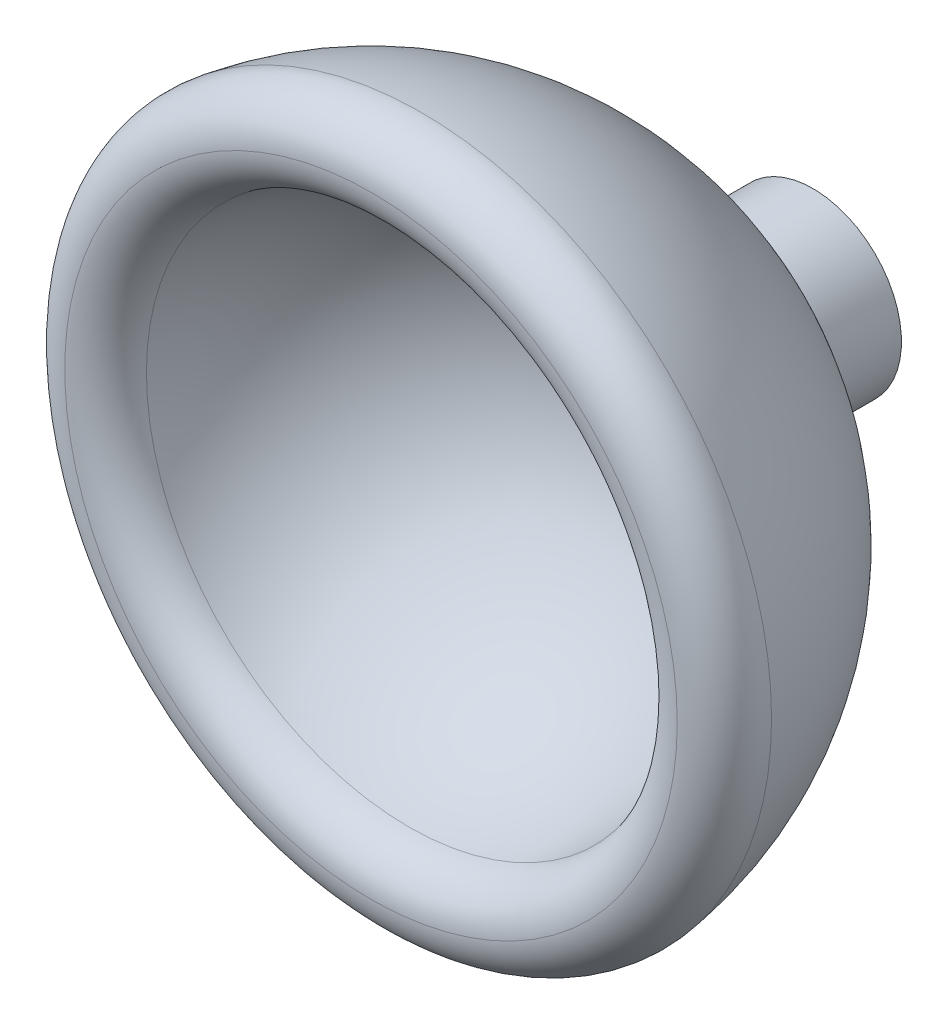
ISO-10303-21;
HEADER;
FILE_DESCRIPTION(('STEP AP214'),'2;1');
FILE_NAME('part.step','',(''),(''),'','','');
FILE_SCHEMA(('AUTOMOTIVE_DESIGN { 1 0 10303 214 1 1 1 1 }'));
ENDSEC;
DATA;
#1=APPLICATION_CONTEXT('core data for automotive mechanical design processes');
#2=APPLICATION_PROTOCOL_DEFINITION('international standard','automotive_design',2000,#1);
#3=PRODUCT_CONTEXT('',#1,'mechanical');
#4=PRODUCT('Part','Part','',(#3));
#5=PRODUCT_RELATED_PRODUCT_CATEGORY('part','',(#4));
#6=PRODUCT_DEFINITION_FORMATION('','',#4);
#7=PRODUCT_DEFINITION_CONTEXT('part definition',#1,'design');
#8=PRODUCT_DEFINITION('design','',#6,#7);
#9=PRODUCT_DEFINITION_SHAPE('','',#8);
#10=(LENGTH_UNIT() NAMED_UNIT(*) SI_UNIT(.MILLI.,.METRE.));
#11=(NAMED_UNIT(*) PLANE_ANGLE_UNIT() SI_UNIT($,.RADIAN.));
#12=(NAMED_UNIT(*) SI_UNIT($,.STERADIAN.) SOLID_ANGLE_UNIT());
#13=UNCERTAINTY_MEASURE_WITH_UNIT(LENGTH_MEASURE(1.E-05),#10,'distance_accuracy_value','');
#14=(GEOMETRIC_REPRESENTATION_CONTEXT(3) GLOBAL_UNCERTAINTY_ASSIGNED_CONTEXT((#13)) GLOBAL_UNIT_ASSIGNED_CONTEXT((#10,
#11,#12)) REPRESENTATION_CONTEXT('',''));
#15=CARTESIAN_POINT('',(0.,0.,0.));
#16=DIRECTION('',(0.,0.,1.));
#17=DIRECTION('',(1.,0.,0.));
#18=AXIS2_PLACEMENT_3D('',#15,#16,#17);
#19=CARTESIAN_POINT('',(0.,0.,-50.));
#20=DIRECTION('',(0.,0.,-1.));
#21=DIRECTION('',(-1.,0.,0.));
#22=AXIS2_PLACEMENT_3D('',#19,#20,#21);
#23=PLANE('',#22);
#24=CARTESIAN_POINT('',(0.,0.,-50.));
#25=DIRECTION('',(0.,0.,-1.));
#26=DIRECTION('',(-1.,0.,0.));
#27=AXIS2_PLACEMENT_3D('',#24,#25,#26);
#28=CIRCLE('',#27,10.);
#29=CARTESIAN_POINT('',(-10.,0.,-50.));
#30=VERTEX_POINT('',#29);
#31=EDGE_CURVE('E50',#30,#30,#28,.T.);
#32=ORIENTED_EDGE('',*,*,#31,.T.);
#33=EDGE_LOOP('',(#32));
#34=FACE_BOUND('',#33,.T.);
#35=ADVANCED_FACE('F36',(#34),#23,.T.);
#36=CARTESIAN_POINT('',(0.,0.,-50.));
#37=DIRECTION('',(0.,0.,-1.));
#38=DIRECTION('',(-1.,0.,0.));
#39=AXIS2_PLACEMENT_3D('',#36,#37,#38);
#40=CYLINDRICAL_SURFACE('',#39,10.);
#41=CARTESIAN_POINT('',(0.,0.,-38.7298334620742));
#42=DIRECTION('',(0.,0.,-1.));
#43=DIRECTION('',(-1.,0.,0.));
#44=AXIS2_PLACEMENT_3D('',#41,#42,#43);
#45=CIRCLE('',#44,10.);
#46=CARTESIAN_POINT('',(10.,0.,-38.7298334620742));
#47=VERTEX_POINT('',#46);
#48=EDGE_CURVE('E56',#47,#47,#45,.T.);
#49=ORIENTED_EDGE('',*,*,#48,.T.);
#50=EDGE_LOOP('',(#49));
#51=FACE_BOUND('',#50,.T.);
#52=ORIENTED_EDGE('',*,*,#31,.F.);
#53=EDGE_LOOP('',(#52));
#54=FACE_BOUND('',#53,.T.);
#55=ADVANCED_FACE('F80',(#51,#54),#40,.T.);
#56=CARTESIAN_POINT('',(0.,0.,0.));
#57=DIRECTION('',(0.,0.,-1.));
#58=DIRECTION('',(1.,0.,0.));
#59=AXIS2_PLACEMENT_3D('',#56,#57,#58);
#60=SPHERICAL_SURFACE('',#59,40.);
#61=CARTESIAN_POINT('',(0.,0.,-5.71428571428572));
#62=DIRECTION('',(0.,0.,1.));
#63=DIRECTION('',(1.,0.,0.));
#64=AXIS2_PLACEMENT_3D('',#61,#62,#63);
#65=CIRCLE('',#64,39.5897327444315);
#66=CARTESIAN_POINT('',(39.5897327444315,0.,-5.71428571428571));
#67=VERTEX_POINT('',#66);
#68=EDGE_CURVE('E10',#67,#67,#65,.F.);
#69=CARTESIAN_POINT('',(39.5897327444315,0.,-5.71428571428571));
#70=CARTESIAN_POINT('',(39.5198103268833,0.,-6.19875285339644));
#71=CARTESIAN_POINT('',(39.4409867529464,0.,-6.68193494193146));
#72=CARTESIAN_POINT('',(39.2656623012291,0.,-7.64508130929309));
#73=CARTESIAN_POINT('',(39.1691614234488,0.,-8.12504558811971));
#74=CARTESIAN_POINT('',(38.9586073729788,0.,-9.08110862750756));
#75=CARTESIAN_POINT('',(38.8445542002891,0.,-9.55720738806879));
#76=CARTESIAN_POINT('',(38.599050605119,0.,-10.5048980533793));
#77=CARTESIAN_POINT('',(38.4676001826386,0.,-10.9764899581286));
#78=CARTESIAN_POINT('',(38.1874788669441,0.,-11.9145313363055));
#79=CARTESIAN_POINT('',(38.03880797373,0.,-12.3809808097331));
#80=CARTESIAN_POINT('',(37.7244461599347,0.,-13.3081087630357));
#81=CARTESIAN_POINT('',(37.5587552393534,0.,-13.7687872429109));
#82=CARTESIAN_POINT('',(37.210576627312,0.,-14.683752401424));
#83=CARTESIAN_POINT('',(37.0280889358518,0.,-15.138039080062));
#84=CARTESIAN_POINT('',(36.6465627065039,0.,-16.0396084478951));
#85=CARTESIAN_POINT('',(36.447524168616,0.,-16.4868911370901));
#86=CARTESIAN_POINT('',(36.033164465704,0.,-17.3738497746906));
#87=CARTESIAN_POINT('',(35.8178433006798,0.,-17.8135257230961));
#88=CARTESIAN_POINT('',(35.3712085073569,0.,-18.6846783789233));
#89=CARTESIAN_POINT('',(35.1398948790581,0.,-19.1161550863451));
#90=CARTESIAN_POINT('',(34.6615868736029,0.,-19.9703278090618));
#91=CARTESIAN_POINT('',(34.4145924964464,0.,-20.3930238243568));
#92=CARTESIAN_POINT('',(33.905255838989,0.,-21.229065544428));
#93=CARTESIAN_POINT('',(33.642913558688,0.,-21.6424112492043));
#94=CARTESIAN_POINT('',(33.1032346231984,0.,-22.4591953301672));
#95=CARTESIAN_POINT('',(32.8258979680098,0.,-22.8626337063538));
#96=CARTESIAN_POINT('',(32.2566040171941,0.,-23.6590594630262));
#97=CARTESIAN_POINT('',(31.9646467215669,0.,-24.0520468435121));
#98=CARTESIAN_POINT('',(31.3665049268615,0.,-24.8270410252663));
#99=CARTESIAN_POINT('',(31.0603204277832,0.,-25.2090478265347));
#100=CARTESIAN_POINT('',(30.4341368355159,0.,-25.9615660635905));
#101=CARTESIAN_POINT('',(30.1141377423268,0.,-26.332077499378));
#102=CARTESIAN_POINT('',(29.4607561875044,0.,-27.0611057101794));
#103=CARTESIAN_POINT('',(29.127373725871,0.,-27.4196224851933));
#104=CARTESIAN_POINT('',(28.4476746950401,0.,-28.1241782429684));
#105=CARTESIAN_POINT('',(28.1013581258426,0.,-28.4702172257295));
#106=CARTESIAN_POINT('',(27.3962575705601,0.,-29.149351082393));
#107=CARTESIAN_POINT('',(27.0374735844751,0.,-29.4824459562954));
#108=CARTESIAN_POINT('',(26.3079216869867,0.,-30.1352427219106));
#109=CARTESIAN_POINT('',(25.9371537755832,0.,-30.4549446136235));
#110=CARTESIAN_POINT('',(25.184133668372,0.,-31.0805245896946));
#111=CARTESIAN_POINT('',(24.8018814725643,0.,-31.3864026740528));
#112=CARTESIAN_POINT('',(24.0264079135005,0.,-31.9839228390034));
#113=CARTESIAN_POINT('',(23.6331865502446,0.,-32.2755649195958));
#114=CARTESIAN_POINT('',(22.8363045551021,0.,-32.8442200647705));
#115=CARTESIAN_POINT('',(22.4326439232156,0.,-33.1212331293528));
#116=CARTESIAN_POINT('',(21.6154273574706,0.,-33.6602569442566));
#117=CARTESIAN_POINT('',(21.201871423612,0.,-33.9222676945781));
#118=CARTESIAN_POINT('',(20.3654215551488,0.,-34.430933798972));
#119=CARTESIAN_POINT('',(19.9425276205441,0.,-34.6775891530444));
#120=CARTESIAN_POINT('',(19.0879716362402,0.,-35.1552120779399));
#121=CARTESIAN_POINT('',(18.6563095865409,0.,-35.3861796487629));
#122=CARTESIAN_POINT('',(17.7847990709142,0.,-35.832115752177));
#123=CARTESIAN_POINT('',(17.3449506049867,0.,-36.047084284768));
#124=CARTESIAN_POINT('',(16.4576599971973,0.,-36.4607326488366));
#125=CARTESIAN_POINT('',(16.0102178553353,0.,-36.6594124803141));
#126=CARTESIAN_POINT('',(15.1083428334693,0.,-37.0402156100446));
#127=CARTESIAN_POINT('',(14.6539099534652,0.,-37.2223389082975));
#128=CARTESIAN_POINT('',(13.7386659466419,0.,-37.569783897227));
#129=CARTESIAN_POINT('',(13.2778548198227,0.,-37.7351055879034));
#130=CARTESIAN_POINT('',(12.3504749098271,0.,-38.0487232627712));
#131=CARTESIAN_POINT('',(11.8839061266508,0.,-38.1970192469625));
#132=CARTESIAN_POINT('',(10.9456411047671,0.,-38.476390571621));
#133=CARTESIAN_POINT('',(10.4739448660598,0.,-38.6074659120883));
#134=CARTESIAN_POINT('',(10.,0.,-38.7298334620742));
#135=B_SPLINE_CURVE_WITH_KNOTS('',3,(#69,#70,#71,#72,#73,#74,#75,#76,#77,#78,#79,#80,#81,#82,
#83,#84,#85,#86,#87,#88,#89,#90,#91,#92,#93,#94,#95,#96,#97,#98,#99,#100,#101,#102,#103,#104,
#105,#106,#107,#108,#109,#110,#111,#112,#113,#114,#115,#116,#117,#118,#119,#120,#121,#122,#123,
#124,#125,#126,#127,#128,#129,#130,#131,#132,#133,#134),.UNSPECIFIED.,.F.,.F.,(4,2,2,2,2,2,2,2,
2,2,2,2,2,2,2,2,2,2,2,2,2,2,2,2,2,2,2,2,2,2,2,2,4),(0.,1.46837816747554,2.93675633495108,
4.40513450242662,5.87351266990216,7.3418908373777,8.81026900485324,10.2786471723288,
11.7470253398043,13.2154035072799,14.6837816747554,16.1521598422309,17.6205380097065,
19.088916177182,20.5572943446575,22.0256725121331,23.4940506796086,24.9624288470842,
26.4308070145597,27.8991851820352,29.3675633495108,30.8359415169863,32.3043196844619,
33.7726978519374,35.2410760194129,36.7094541868885,38.177832354364,39.6462105218396,
41.1145886893151,42.5829668567906,44.0513450242662,45.5197231917417,46.9881013592173),.UNSPECIFIED.);
#136=EDGE_CURVE('BSEAM76',#67,#47,#135,.T.);
#137=ORIENTED_EDGE('',*,*,#68,.T.);
#138=ORIENTED_EDGE('',*,*,#48,.F.);
#139=ORIENTED_EDGE('',*,*,#136,.T.);
#140=ORIENTED_EDGE('',*,*,#136,.F.);
#141=EDGE_LOOP('',(#137,#139,#138,#140));
#142=FACE_BOUND('',#141,.T.);
#143=ADVANCED_FACE('F76',(#142),#60,.T.);
#144=CARTESIAN_POINT('',(0.,0.,0.));
#145=DIRECTION('',(0.,0.,-1.));
#146=DIRECTION('',(-1.,0.,0.));
#147=AXIS2_PLACEMENT_3D('',#144,#145,#146);
#148=SPHERICAL_SURFACE('',#147,30.);
#149=CARTESIAN_POINT('',(0.,0.,-4.28571428571429));
#150=DIRECTION('',(0.,0.,1.));
#151=DIRECTION('',(1.,0.,0.));
#152=AXIS2_PLACEMENT_3D('',#149,#150,#151);
#153=CIRCLE('',#152,29.6922995583236);
#154=CARTESIAN_POINT('',(29.6922995583236,0.,-4.28571428571429));
#155=VERTEX_POINT('',#154);
#156=EDGE_CURVE('E45',#155,#155,#153,.T.);
#157=ORIENTED_EDGE('',*,*,#156,.T.);
#158=EDGE_LOOP('',(#157));
#159=FACE_BOUND('',#158,.T.);
#160=ADVANCED_FACE('F68',(#159),#148,.F.);
#161=CARTESIAN_POINT('',(0.,0.,-5.00000000000001));
#162=DIRECTION('',(0.,0.,1.));
#163=DIRECTION('',(1.,0.,0.));
#164=AXIS2_PLACEMENT_3D('',#161,#162,#163);
#165=TOROIDAL_SURFACE('',#164,34.6410161513775,5.);
#166=ORIENTED_EDGE('',*,*,#68,.F.);
#167=EDGE_LOOP('',(#166));
#168=FACE_BOUND('',#167,.T.);
#169=CARTESIAN_POINT('',(0.,0.,0.));
#170=DIRECTION('',(0.,0.,1.));
#171=DIRECTION('',(1.,0.,0.));
#172=AXIS2_PLACEMENT_3D('',#169,#170,#171);
#173=CIRCLE('',#172,34.6410161513775);
#174=CARTESIAN_POINT('',(34.6410161513775,0.,0.));
#175=VERTEX_POINT('',#174);
#176=EDGE_CURVE('E40',#175,#175,#173,.T.);
#177=ORIENTED_EDGE('',*,*,#176,.F.);
#178=EDGE_LOOP('',(#177));
#179=FACE_BOUND('',#178,.T.);
#180=ADVANCED_FACE('F38',(#168,#179),#165,.T.);
#181=CARTESIAN_POINT('',(0.,0.,-5.00000000000001));
#182=DIRECTION('',(0.,0.,1.));
#183=DIRECTION('',(1.,0.,0.));
#184=AXIS2_PLACEMENT_3D('',#181,#182,#183);
#185=TOROIDAL_SURFACE('',#184,34.6410161513775,5.);
#186=ORIENTED_EDGE('',*,*,#156,.F.);
#187=EDGE_LOOP('',(#186));
#188=FACE_BOUND('',#187,.T.);
#189=ORIENTED_EDGE('',*,*,#176,.T.);
#190=EDGE_LOOP('',(#189));
#191=FACE_BOUND('',#190,.T.);
#192=ADVANCED_FACE('F65',(#188,#191),#185,.T.);
#193=CLOSED_SHELL('',(#35,#55,#143,#160,#180,#192));
#194=MANIFOLD_SOLID_BREP('B2',#193);
#195=ADVANCED_BREP_SHAPE_REPRESENTATION('',(#18,#194),#14);
#196=SHAPE_DEFINITION_REPRESENTATION(#9,#195);
ENDSEC;
END-ISO-10303-21;
